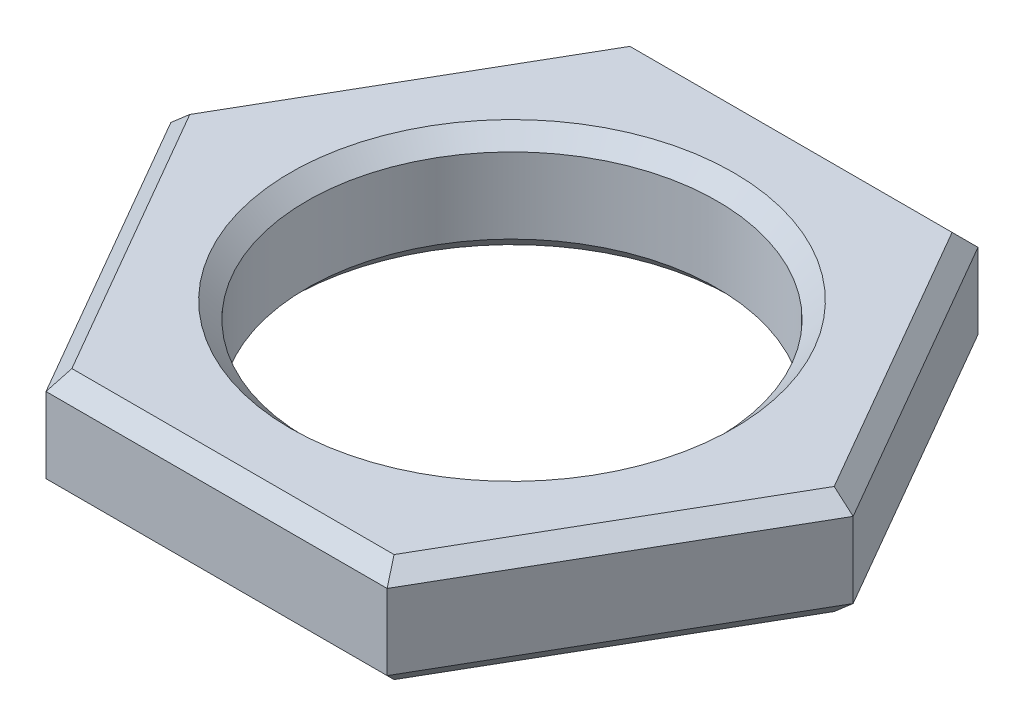
ISO-10303-21;
HEADER;
FILE_DESCRIPTION(('STEP AP214'),'2;1');
FILE_NAME('part.step','',(''),(''),'','','');
FILE_SCHEMA(('AUTOMOTIVE_DESIGN { 1 0 10303 214 1 1 1 1 }'));
ENDSEC;
DATA;
#1=APPLICATION_CONTEXT('core data for automotive mechanical design processes');
#2=APPLICATION_PROTOCOL_DEFINITION('international standard','automotive_design',2000,#1);
#3=PRODUCT_CONTEXT('',#1,'mechanical');
#4=PRODUCT('Part','Part','',(#3));
#5=PRODUCT_RELATED_PRODUCT_CATEGORY('part','',(#4));
#6=PRODUCT_DEFINITION_FORMATION('','',#4);
#7=PRODUCT_DEFINITION_CONTEXT('part definition',#1,'design');
#8=PRODUCT_DEFINITION('design','',#6,#7);
#9=PRODUCT_DEFINITION_SHAPE('','',#8);
#10=(LENGTH_UNIT() NAMED_UNIT(*) SI_UNIT(.MILLI.,.METRE.));
#11=(NAMED_UNIT(*) PLANE_ANGLE_UNIT() SI_UNIT($,.RADIAN.));
#12=(NAMED_UNIT(*) SI_UNIT($,.STERADIAN.) SOLID_ANGLE_UNIT());
#13=UNCERTAINTY_MEASURE_WITH_UNIT(LENGTH_MEASURE(1.E-05),#10,'distance_accuracy_value','');
#14=(GEOMETRIC_REPRESENTATION_CONTEXT(3) GLOBAL_UNCERTAINTY_ASSIGNED_CONTEXT((#13)) GLOBAL_UNIT_ASSIGNED_CONTEXT((#10,
#11,#12)) REPRESENTATION_CONTEXT('',''));
#15=CARTESIAN_POINT('',(0.,0.,0.));
#16=DIRECTION('',(0.,0.,1.));
#17=DIRECTION('',(1.,0.,0.));
#18=AXIS2_PLACEMENT_3D('',#15,#16,#17);
#19=CARTESIAN_POINT('',(0.,1.65,0.));
#20=DIRECTION('',(0.,1.,0.));
#21=DIRECTION('',(0.,0.,1.));
#22=AXIS2_PLACEMENT_3D('',#19,#20,#21);
#23=PLANE('',#22);
#24=CARTESIAN_POINT('',(0.,1.65,0.));
#25=DIRECTION('',(0.,1.,0.));
#26=DIRECTION('',(0.,0.,1.));
#27=AXIS2_PLACEMENT_3D('',#24,#25,#26);
#28=CIRCLE('',#27,3.375);
#29=CARTESIAN_POINT('',(0.,1.65,3.375));
#30=VERTEX_POINT('',#29);
#31=EDGE_CURVE('E11',#30,#30,#28,.F.);
#32=ORIENTED_EDGE('',*,*,#31,.T.);
#33=EDGE_LOOP('',(#32));
#34=FACE_BOUND('',#33,.T.);
#35=DIRECTION('',(0.500000000000007,0.,0.866025403784435));
#36=VECTOR('',#35,1.);
#37=CARTESIAN_POINT('',(-2.38156986040717,1.65,4.37500000000002));
#38=LINE('',#37,#36);
#39=CARTESIAN_POINT('',(-4.90747728811182,1.65,0.));
#40=VERTEX_POINT('',#39);
#41=CARTESIAN_POINT('',(-2.45373864405587,1.65,4.25000000000002));
#42=VERTEX_POINT('',#41);
#43=EDGE_CURVE('E57',#40,#42,#38,.T.);
#44=ORIENTED_EDGE('',*,*,#43,.T.);
#45=DIRECTION('',(1.,0.,0.));
#46=VECTOR('',#45,1.);
#47=CARTESIAN_POINT('',(2.59807621135337,1.65,4.24999999999997));
#48=LINE('',#47,#46);
#49=CARTESIAN_POINT('',(2.45373864405596,1.65,4.24999999999997));
#50=VERTEX_POINT('',#49);
#51=EDGE_CURVE('E49',#42,#50,#48,.T.);
#52=ORIENTED_EDGE('',*,*,#51,.T.);
#53=DIRECTION('',(0.499999999999995,0.,-0.866025403784442));
#54=VECTOR('',#53,1.);
#55=CARTESIAN_POINT('',(4.97964607176052,1.65,-0.124999999999999));
#56=LINE('',#55,#54);
#57=CARTESIAN_POINT('',(4.90747728811182,1.65,0.));
#58=VERTEX_POINT('',#57);
#59=EDGE_CURVE('E215',#50,#58,#56,.T.);
#60=ORIENTED_EDGE('',*,*,#59,.T.);
#61=DIRECTION('',(-0.500000000000001,0.,-0.866025403784438));
#62=VECTOR('',#61,1.);
#63=CARTESIAN_POINT('',(2.3815698604072,1.65,-4.37500000000001));
#64=LINE('',#63,#62);
#65=CARTESIAN_POINT('',(2.4537386440559,1.65,-4.25000000000001));
#66=VERTEX_POINT('',#65);
#67=EDGE_CURVE('E218',#58,#66,#64,.T.);
#68=ORIENTED_EDGE('',*,*,#67,.T.);
#69=DIRECTION('',(-1.,0.,0.));
#70=VECTOR('',#69,1.);
#71=CARTESIAN_POINT('',(-2.59807621135334,1.65,-4.24999999999999));
#72=LINE('',#71,#70);
#73=CARTESIAN_POINT('',(-2.45373864405593,1.65,-4.24999999999999));
#74=VERTEX_POINT('',#73);
#75=EDGE_CURVE('E221',#66,#74,#72,.T.);
#76=ORIENTED_EDGE('',*,*,#75,.T.);
#77=DIRECTION('',(-0.499999999999995,0.,0.866025403784442));
#78=VECTOR('',#77,1.);
#79=CARTESIAN_POINT('',(-4.97964607176053,1.65,0.125000000000035));
#80=LINE('',#79,#78);
#81=EDGE_CURVE('E62',#74,#40,#80,.T.);
#82=ORIENTED_EDGE('',*,*,#81,.T.);
#83=EDGE_LOOP('',(#44,#52,#60,#68,#76,#82));
#84=FACE_BOUND('',#83,.T.);
#85=ADVANCED_FACE('F39',(#34,#84),#23,.T.);
#86=CARTESIAN_POINT('',(0.,0.,0.));
#87=DIRECTION('',(0.,1.,0.));
#88=DIRECTION('',(0.,0.,1.));
#89=AXIS2_PLACEMENT_3D('',#86,#87,#88);
#90=PLANE('',#89);
#91=CARTESIAN_POINT('',(0.,0.,0.));
#92=DIRECTION('',(0.,1.,0.));
#93=DIRECTION('',(0.,0.,1.));
#94=AXIS2_PLACEMENT_3D('',#91,#92,#93);
#95=CIRCLE('',#94,3.375);
#96=CARTESIAN_POINT('',(0.,0.,3.375));
#97=VERTEX_POINT('',#96);
#98=EDGE_CURVE('E161',#97,#97,#95,.T.);
#99=ORIENTED_EDGE('',*,*,#98,.T.);
#100=EDGE_LOOP('',(#99));
#101=FACE_BOUND('',#100,.T.);
#102=DIRECTION('',(1.,0.,0.));
#103=VECTOR('',#102,1.);
#104=CARTESIAN_POINT('',(0.,0.,-4.25));
#105=LINE('',#104,#103);
#106=CARTESIAN_POINT('',(-2.45373864405593,0.,-4.24999999999999));
#107=VERTEX_POINT('',#106);
#108=CARTESIAN_POINT('',(2.4537386440559,0.,-4.25000000000001));
#109=VERTEX_POINT('',#108);
#110=EDGE_CURVE('E159',#107,#109,#105,.T.);
#111=ORIENTED_EDGE('',*,*,#110,.T.);
#112=DIRECTION('',(0.500000000000001,0.,0.866025403784438));
#113=VECTOR('',#112,1.);
#114=CARTESIAN_POINT('',(3.68060796608386,0.,-2.125));
#115=LINE('',#114,#113);
#116=CARTESIAN_POINT('',(4.90747728811182,0.,0.));
#117=VERTEX_POINT('',#116);
#118=EDGE_CURVE('E136',#109,#117,#115,.T.);
#119=ORIENTED_EDGE('',*,*,#118,.T.);
#120=DIRECTION('',(-0.499999999999995,0.,0.866025403784442));
#121=VECTOR('',#120,1.);
#122=CARTESIAN_POINT('',(3.68060796608389,0.,2.12499999999999));
#123=LINE('',#122,#121);
#124=CARTESIAN_POINT('',(2.45373864405596,0.,4.24999999999997));
#125=VERTEX_POINT('',#124);
#126=EDGE_CURVE('E147',#117,#125,#123,.T.);
#127=ORIENTED_EDGE('',*,*,#126,.T.);
#128=DIRECTION('',(-1.,0.,0.));
#129=VECTOR('',#128,1.);
#130=CARTESIAN_POINT('',(0.,0.,4.25));
#131=LINE('',#130,#129);
#132=CARTESIAN_POINT('',(-2.45373864405587,0.,4.25000000000002));
#133=VERTEX_POINT('',#132);
#134=EDGE_CURVE('E154',#125,#133,#131,.T.);
#135=ORIENTED_EDGE('',*,*,#134,.T.);
#136=DIRECTION('',(-0.500000000000007,0.,-0.866025403784435));
#137=VECTOR('',#136,1.);
#138=CARTESIAN_POINT('',(-3.68060796608385,0.,2.12500000000003));
#139=LINE('',#138,#137);
#140=CARTESIAN_POINT('',(-4.90747728811182,0.,0.));
#141=VERTEX_POINT('',#140);
#142=EDGE_CURVE('E298',#133,#141,#139,.T.);
#143=ORIENTED_EDGE('',*,*,#142,.T.);
#144=DIRECTION('',(0.499999999999995,0.,-0.866025403784442));
#145=VECTOR('',#144,1.);
#146=CARTESIAN_POINT('',(-3.68060796608388,0.,-2.12499999999998));
#147=LINE('',#146,#145);
#148=EDGE_CURVE('E168',#141,#107,#147,.T.);
#149=ORIENTED_EDGE('',*,*,#148,.T.);
#150=EDGE_LOOP('',(#111,#119,#127,#135,#143,#149));
#151=FACE_BOUND('',#150,.T.);
#152=ADVANCED_FACE('F157',(#101,#151),#90,.F.);
#153=CARTESIAN_POINT('',(2.59807621135337,1.65,4.49999999999997));
#154=DIRECTION('',(-0.866025403784442,0.,-0.499999999999995));
#155=DIRECTION('',(-0.499999999999995,0.,0.866025403784442));
#156=AXIS2_PLACEMENT_3D('',#153,#154,#155);
#157=PLANE('',#156);
#158=DIRECTION('',(0.,-1.,0.));
#159=VECTOR('',#158,1.);
#160=CARTESIAN_POINT('',(2.59807621135337,1.65,4.49999999999997));
#161=LINE('',#160,#159);
#162=CARTESIAN_POINT('',(2.59807621135337,1.4,4.49999999999997));
#163=VERTEX_POINT('',#162);
#164=CARTESIAN_POINT('',(2.59807621135337,0.250000000000001,4.49999999999997));
#165=VERTEX_POINT('',#164);
#166=EDGE_CURVE('E245',#163,#165,#161,.T.);
#167=ORIENTED_EDGE('',*,*,#166,.T.);
#168=DIRECTION('',(0.499999999999995,0.,-0.866025403784442));
#169=VECTOR('',#168,1.);
#170=CARTESIAN_POINT('',(2.59807621135337,0.250000000000001,4.49999999999997));
#171=LINE('',#170,#169);
#172=CARTESIAN_POINT('',(5.19615242270664,0.250000000000001,0.));
#173=VERTEX_POINT('',#172);
#174=EDGE_CURVE('E212',#165,#173,#171,.T.);
#175=ORIENTED_EDGE('',*,*,#174,.T.);
#176=DIRECTION('',(0.,-1.,0.));
#177=VECTOR('',#176,1.);
#178=CARTESIAN_POINT('',(5.19615242270664,1.65,0.));
#179=LINE('',#178,#177);
#180=CARTESIAN_POINT('',(5.19615242270664,1.4,0.));
#181=VERTEX_POINT('',#180);
#182=EDGE_CURVE('E155',#181,#173,#179,.T.);
#183=ORIENTED_EDGE('',*,*,#182,.F.);
#184=DIRECTION('',(-0.499999999999995,0.,0.866025403784442));
#185=VECTOR('',#184,1.);
#186=CARTESIAN_POINT('',(2.59807621135337,1.4,4.49999999999997));
#187=LINE('',#186,#185);
#188=EDGE_CURVE('E209',#181,#163,#187,.T.);
#189=ORIENTED_EDGE('',*,*,#188,.T.);
#190=EDGE_LOOP('',(#167,#175,#183,#189));
#191=FACE_BOUND('',#190,.T.);
#192=ADVANCED_FACE('F327',(#191),#157,.F.);
#193=CARTESIAN_POINT('',(5.19615242270664,1.65,0.));
#194=DIRECTION('',(-0.866025403784438,0.,0.500000000000001));
#195=DIRECTION('',(0.500000000000001,0.,0.866025403784438));
#196=AXIS2_PLACEMENT_3D('',#193,#194,#195);
#197=PLANE('',#196);
#198=ORIENTED_EDGE('',*,*,#182,.T.);
#199=DIRECTION('',(-0.500000000000001,0.,-0.866025403784438));
#200=VECTOR('',#199,1.);
#201=CARTESIAN_POINT('',(5.19615242270664,0.250000000000001,0.));
#202=LINE('',#201,#200);
#203=CARTESIAN_POINT('',(2.59807621135331,0.25,-4.50000000000001));
#204=VERTEX_POINT('',#203);
#205=EDGE_CURVE('E139',#173,#204,#202,.T.);
#206=ORIENTED_EDGE('',*,*,#205,.T.);
#207=DIRECTION('',(0.,-1.,0.));
#208=VECTOR('',#207,1.);
#209=CARTESIAN_POINT('',(2.59807621135331,1.65,-4.50000000000001));
#210=LINE('',#209,#208);
#211=CARTESIAN_POINT('',(2.59807621135331,1.4,-4.50000000000001));
#212=VERTEX_POINT('',#211);
#213=EDGE_CURVE('E280',#212,#204,#210,.T.);
#214=ORIENTED_EDGE('',*,*,#213,.F.);
#215=DIRECTION('',(0.500000000000001,0.,0.866025403784438));
#216=VECTOR('',#215,1.);
#217=CARTESIAN_POINT('',(5.19615242270664,1.4,0.));
#218=LINE('',#217,#216);
#219=EDGE_CURVE('E179',#212,#181,#218,.T.);
#220=ORIENTED_EDGE('',*,*,#219,.T.);
#221=EDGE_LOOP('',(#198,#206,#214,#220));
#222=FACE_BOUND('',#221,.T.);
#223=ADVANCED_FACE('F285',(#222),#197,.F.);
#224=CARTESIAN_POINT('',(2.59807621135331,1.65,-4.50000000000001));
#225=DIRECTION('',(0.,0.,1.));
#226=DIRECTION('',(1.,0.,0.));
#227=AXIS2_PLACEMENT_3D('',#224,#225,#226);
#228=PLANE('',#227);
#229=ORIENTED_EDGE('',*,*,#213,.T.);
#230=DIRECTION('',(-1.,0.,0.));
#231=VECTOR('',#230,1.);
#232=CARTESIAN_POINT('',(2.59807621135331,0.25,-4.50000000000001));
#233=LINE('',#232,#231);
#234=CARTESIAN_POINT('',(-2.59807621135334,0.25,-4.49999999999999));
#235=VERTEX_POINT('',#234);
#236=EDGE_CURVE('E187',#204,#235,#233,.T.);
#237=ORIENTED_EDGE('',*,*,#236,.T.);
#238=DIRECTION('',(0.,-1.,0.));
#239=VECTOR('',#238,1.);
#240=CARTESIAN_POINT('',(-2.59807621135334,1.65,-4.49999999999999));
#241=LINE('',#240,#239);
#242=CARTESIAN_POINT('',(-2.59807621135334,1.4,-4.49999999999999));
#243=VERTEX_POINT('',#242);
#244=EDGE_CURVE('E282',#243,#235,#241,.T.);
#245=ORIENTED_EDGE('',*,*,#244,.F.);
#246=DIRECTION('',(1.,0.,0.));
#247=VECTOR('',#246,1.);
#248=CARTESIAN_POINT('',(2.59807621135331,1.4,-4.50000000000001));
#249=LINE('',#248,#247);
#250=EDGE_CURVE('E184',#243,#212,#249,.T.);
#251=ORIENTED_EDGE('',*,*,#250,.T.);
#252=EDGE_LOOP('',(#229,#237,#245,#251));
#253=FACE_BOUND('',#252,.T.);
#254=ADVANCED_FACE('F279',(#253),#228,.F.);
#255=CARTESIAN_POINT('',(-2.59807621135334,1.65,-4.49999999999999));
#256=DIRECTION('',(0.866025403784442,0.,0.499999999999995));
#257=DIRECTION('',(0.499999999999995,0.,-0.866025403784442));
#258=AXIS2_PLACEMENT_3D('',#255,#256,#257);
#259=PLANE('',#258);
#260=ORIENTED_EDGE('',*,*,#244,.T.);
#261=DIRECTION('',(-0.499999999999995,0.,0.866025403784442));
#262=VECTOR('',#261,1.);
#263=CARTESIAN_POINT('',(-2.59807621135334,0.25,-4.49999999999999));
#264=LINE('',#263,#262);
#265=CARTESIAN_POINT('',(-5.19615242270664,0.25,0.));
#266=VERTEX_POINT('',#265);
#267=EDGE_CURVE('E193',#235,#266,#264,.T.);
#268=ORIENTED_EDGE('',*,*,#267,.T.);
#269=DIRECTION('',(0.,-1.,0.));
#270=VECTOR('',#269,1.);
#271=CARTESIAN_POINT('',(-5.19615242270664,1.65,0.));
#272=LINE('',#271,#270);
#273=CARTESIAN_POINT('',(-5.19615242270664,1.4,0.));
#274=VERTEX_POINT('',#273);
#275=EDGE_CURVE('E292',#274,#266,#272,.T.);
#276=ORIENTED_EDGE('',*,*,#275,.F.);
#277=DIRECTION('',(0.499999999999995,0.,-0.866025403784442));
#278=VECTOR('',#277,1.);
#279=CARTESIAN_POINT('',(-2.59807621135334,1.4,-4.49999999999999));
#280=LINE('',#279,#278);
#281=EDGE_CURVE('E190',#274,#243,#280,.T.);
#282=ORIENTED_EDGE('',*,*,#281,.T.);
#283=EDGE_LOOP('',(#260,#268,#276,#282));
#284=FACE_BOUND('',#283,.T.);
#285=ADVANCED_FACE('F312',(#284),#259,.F.);
#286=CARTESIAN_POINT('',(-5.19615242270664,1.65,0.));
#287=DIRECTION('',(0.866025403784435,0.,-0.500000000000007));
#288=DIRECTION('',(-0.500000000000007,0.,-0.866025403784435));
#289=AXIS2_PLACEMENT_3D('',#286,#287,#288);
#290=PLANE('',#289);
#291=ORIENTED_EDGE('',*,*,#275,.T.);
#292=DIRECTION('',(0.500000000000007,0.,0.866025403784435));
#293=VECTOR('',#292,1.);
#294=CARTESIAN_POINT('',(-5.19615242270664,0.25,0.));
#295=LINE('',#294,#293);
#296=CARTESIAN_POINT('',(-2.59807621135328,0.25,4.50000000000003));
#297=VERTEX_POINT('',#296);
#298=EDGE_CURVE('E199',#266,#297,#295,.T.);
#299=ORIENTED_EDGE('',*,*,#298,.T.);
#300=DIRECTION('',(0.,-1.,0.));
#301=VECTOR('',#300,1.);
#302=CARTESIAN_POINT('',(-2.59807621135328,1.65,4.50000000000003));
#303=LINE('',#302,#301);
#304=CARTESIAN_POINT('',(-2.59807621135328,1.4,4.50000000000003));
#305=VERTEX_POINT('',#304);
#306=EDGE_CURVE('E318',#305,#297,#303,.T.);
#307=ORIENTED_EDGE('',*,*,#306,.F.);
#308=DIRECTION('',(-0.500000000000007,0.,-0.866025403784435));
#309=VECTOR('',#308,1.);
#310=CARTESIAN_POINT('',(-5.19615242270664,1.4,0.));
#311=LINE('',#310,#309);
#312=EDGE_CURVE('E196',#305,#274,#311,.T.);
#313=ORIENTED_EDGE('',*,*,#312,.T.);
#314=EDGE_LOOP('',(#291,#299,#307,#313));
#315=FACE_BOUND('',#314,.T.);
#316=ADVANCED_FACE('F338',(#315),#290,.F.);
#317=CARTESIAN_POINT('',(-2.59807621135328,1.65,4.50000000000003));
#318=DIRECTION('',(0.,0.,-1.));
#319=DIRECTION('',(-1.,0.,0.));
#320=AXIS2_PLACEMENT_3D('',#317,#318,#319);
#321=PLANE('',#320);
#322=ORIENTED_EDGE('',*,*,#306,.T.);
#323=DIRECTION('',(1.,0.,0.));
#324=VECTOR('',#323,1.);
#325=CARTESIAN_POINT('',(-2.59807621135328,0.25,4.50000000000003));
#326=LINE('',#325,#324);
#327=EDGE_CURVE('E206',#297,#165,#326,.T.);
#328=ORIENTED_EDGE('',*,*,#327,.T.);
#329=ORIENTED_EDGE('',*,*,#166,.F.);
#330=DIRECTION('',(-1.,0.,0.));
#331=VECTOR('',#330,1.);
#332=CARTESIAN_POINT('',(-2.59807621135328,1.4,4.50000000000003));
#333=LINE('',#332,#331);
#334=EDGE_CURVE('E202',#163,#305,#333,.T.);
#335=ORIENTED_EDGE('',*,*,#334,.T.);
#336=EDGE_LOOP('',(#322,#328,#329,#335));
#337=FACE_BOUND('',#336,.T.);
#338=ADVANCED_FACE('F339',(#337),#321,.F.);
#339=CARTESIAN_POINT('',(0.,1.65,0.));
#340=DIRECTION('',(0.,-1.,0.));
#341=DIRECTION('',(0.,0.,-1.));
#342=AXIS2_PLACEMENT_3D('',#339,#340,#341);
#343=CYLINDRICAL_SURFACE('',#342,3.125);
#344=CARTESIAN_POINT('',(0.,0.250000000000001,0.));
#345=DIRECTION('',(0.,1.,0.));
#346=DIRECTION('',(0.,0.,1.));
#347=AXIS2_PLACEMENT_3D('',#344,#345,#346);
#348=CIRCLE('',#347,3.125);
#349=CARTESIAN_POINT('',(0.,0.250000000000001,3.125));
#350=VERTEX_POINT('',#349);
#351=EDGE_CURVE('E175',#350,#350,#348,.F.);
#352=ORIENTED_EDGE('',*,*,#351,.T.);
#353=EDGE_LOOP('',(#352));
#354=FACE_BOUND('',#353,.T.);
#355=CARTESIAN_POINT('',(0.,1.4,0.));
#356=DIRECTION('',(0.,1.,0.));
#357=DIRECTION('',(0.,0.,1.));
#358=AXIS2_PLACEMENT_3D('',#355,#356,#357);
#359=CIRCLE('',#358,3.125);
#360=CARTESIAN_POINT('',(0.,1.4,3.125));
#361=VERTEX_POINT('',#360);
#362=EDGE_CURVE('E166',#361,#361,#359,.T.);
#363=ORIENTED_EDGE('',*,*,#362,.T.);
#364=EDGE_LOOP('',(#363));
#365=FACE_BOUND('',#364,.T.);
#366=ADVANCED_FACE('F358',(#354,#365),#343,.F.);
#367=CARTESIAN_POINT('',(0.,0.,0.));
#368=DIRECTION('',(0.,-1.,0.));
#369=DIRECTION('',(0.,0.,-1.));
#370=AXIS2_PLACEMENT_3D('',#367,#368,#369);
#371=CONICAL_SURFACE('',#370,3.375,0.785398163397447);
#372=ORIENTED_EDGE('',*,*,#351,.F.);
#373=EDGE_LOOP('',(#372));
#374=FACE_BOUND('',#373,.T.);
#375=ORIENTED_EDGE('',*,*,#98,.F.);
#376=EDGE_LOOP('',(#375));
#377=FACE_BOUND('',#376,.T.);
#378=ADVANCED_FACE('F372',(#374,#377),#371,.F.);
#379=CARTESIAN_POINT('',(-5.19615242270664,0.25,0.));
#380=DIRECTION('',(0.612372435695791,0.707106781186548,-0.353553390593278));
#381=DIRECTION('',(0.500000000000007,0.,0.866025403784435));
#382=AXIS2_PLACEMENT_3D('',#379,#380,#381);
#383=PLANE('',#382);
#384=DIRECTION('',(0.755928946018454,-0.654653670707977,0.));
#385=VECTOR('',#384,1.);
#386=CARTESIAN_POINT('',(-5.19615242270664,0.25,0.));
#387=LINE('',#386,#385);
#388=EDGE_CURVE('E237',#141,#266,#387,.F.);
#389=ORIENTED_EDGE('',*,*,#388,.F.);
#390=ORIENTED_EDGE('',*,*,#142,.F.);
#391=DIRECTION('',(0.377964473009222,-0.654653670707977,-0.65465367070798));
#392=VECTOR('',#391,1.);
#393=CARTESIAN_POINT('',(-2.59807621135328,0.25,4.50000000000003));
#394=LINE('',#393,#392);
#395=EDGE_CURVE('E241',#297,#133,#394,.T.);
#396=ORIENTED_EDGE('',*,*,#395,.F.);
#397=ORIENTED_EDGE('',*,*,#298,.F.);
#398=EDGE_LOOP('',(#389,#390,#396,#397));
#399=FACE_BOUND('',#398,.T.);
#400=ADVANCED_FACE('F336',(#399),#383,.F.);
#401=CARTESIAN_POINT('',(-2.59807621135328,0.25,4.50000000000003));
#402=DIRECTION('',(0.,0.707106781186547,-0.707106781186547));
#403=DIRECTION('',(1.,0.,0.));
#404=AXIS2_PLACEMENT_3D('',#401,#402,#403);
#405=PLANE('',#404);
#406=ORIENTED_EDGE('',*,*,#395,.T.);
#407=ORIENTED_EDGE('',*,*,#134,.F.);
#408=DIRECTION('',(-0.377964473009234,-0.654653670707977,-0.654653670707973));
#409=VECTOR('',#408,1.);
#410=CARTESIAN_POINT('',(2.59807621135337,0.25,4.49999999999997));
#411=LINE('',#410,#409);
#412=EDGE_CURVE('E150',#165,#125,#411,.T.);
#413=ORIENTED_EDGE('',*,*,#412,.F.);
#414=ORIENTED_EDGE('',*,*,#327,.F.);
#415=EDGE_LOOP('',(#406,#407,#413,#414));
#416=FACE_BOUND('',#415,.T.);
#417=ADVANCED_FACE('F333',(#416),#405,.F.);
#418=CARTESIAN_POINT('',(-2.59807621135334,0.25,-4.49999999999999));
#419=DIRECTION('',(0.612372435695798,0.707106781186546,0.353553390593271));
#420=DIRECTION('',(-0.499999999999995,0.,0.866025403784442));
#421=AXIS2_PLACEMENT_3D('',#418,#419,#420);
#422=PLANE('',#421);
#423=ORIENTED_EDGE('',*,*,#388,.T.);
#424=ORIENTED_EDGE('',*,*,#267,.F.);
#425=DIRECTION('',(0.377964473009228,-0.654653670707978,0.654653670707976));
#426=VECTOR('',#425,1.);
#427=CARTESIAN_POINT('',(-2.59807621135334,0.25,-4.49999999999999));
#428=LINE('',#427,#426);
#429=EDGE_CURVE('E143',#107,#235,#428,.F.);
#430=ORIENTED_EDGE('',*,*,#429,.F.);
#431=ORIENTED_EDGE('',*,*,#148,.F.);
#432=EDGE_LOOP('',(#423,#424,#430,#431));
#433=FACE_BOUND('',#432,.T.);
#434=ADVANCED_FACE('F307',(#433),#422,.F.);
#435=CARTESIAN_POINT('',(2.59807621135337,0.25,4.49999999999997));
#436=DIRECTION('',(-0.612372435695796,0.707106781186548,-0.35355339059327));
#437=DIRECTION('',(0.499999999999995,0.,-0.866025403784442));
#438=AXIS2_PLACEMENT_3D('',#435,#436,#437);
#439=PLANE('',#438);
#440=ORIENTED_EDGE('',*,*,#412,.T.);
#441=ORIENTED_EDGE('',*,*,#126,.F.);
#442=DIRECTION('',(0.755928946018454,0.654653670707978,0.));
#443=VECTOR('',#442,1.);
#444=CARTESIAN_POINT('',(3.71153744479049,-1.03571428571426,0.));
#445=LINE('',#444,#443);
#446=EDGE_CURVE('E132',#173,#117,#445,.F.);
#447=ORIENTED_EDGE('',*,*,#446,.F.);
#448=ORIENTED_EDGE('',*,*,#174,.F.);
#449=EDGE_LOOP('',(#440,#441,#447,#448));
#450=FACE_BOUND('',#449,.T.);
#451=ADVANCED_FACE('F148',(#450),#439,.F.);
#452=CARTESIAN_POINT('',(2.59807621135331,0.25,-4.50000000000001));
#453=DIRECTION('',(0.,0.707106781186547,0.707106781186548));
#454=DIRECTION('',(-1.,0.,0.));
#455=AXIS2_PLACEMENT_3D('',#452,#453,#454);
#456=PLANE('',#455);
#457=ORIENTED_EDGE('',*,*,#429,.T.);
#458=ORIENTED_EDGE('',*,*,#236,.F.);
#459=DIRECTION('',(-0.377964473009226,-0.654653670707978,0.654653670707978));
#460=VECTOR('',#459,1.);
#461=CARTESIAN_POINT('',(2.59807621135331,0.25,-4.50000000000001));
#462=LINE('',#461,#460);
#463=EDGE_CURVE('E144',#109,#204,#462,.F.);
#464=ORIENTED_EDGE('',*,*,#463,.F.);
#465=ORIENTED_EDGE('',*,*,#110,.F.);
#466=EDGE_LOOP('',(#457,#458,#464,#465));
#467=FACE_BOUND('',#466,.T.);
#468=ADVANCED_FACE('F310',(#467),#456,.F.);
#469=CARTESIAN_POINT('',(5.19615242270664,0.25,0.));
#470=DIRECTION('',(-0.612372435695795,0.707106781186547,0.353553390593275));
#471=DIRECTION('',(-0.500000000000001,0.,-0.866025403784438));
#472=AXIS2_PLACEMENT_3D('',#469,#470,#471);
#473=PLANE('',#472);
#474=ORIENTED_EDGE('',*,*,#446,.T.);
#475=ORIENTED_EDGE('',*,*,#118,.F.);
#476=ORIENTED_EDGE('',*,*,#463,.T.);
#477=ORIENTED_EDGE('',*,*,#205,.F.);
#478=EDGE_LOOP('',(#474,#475,#476,#477));
#479=FACE_BOUND('',#478,.T.);
#480=ADVANCED_FACE('F134',(#479),#473,.F.);
#481=CARTESIAN_POINT('',(0.,1.4,0.));
#482=DIRECTION('',(0.,1.,0.));
#483=DIRECTION('',(0.,0.,1.));
#484=AXIS2_PLACEMENT_3D('',#481,#482,#483);
#485=CONICAL_SURFACE('',#484,3.125,0.785398163397451);
#486=ORIENTED_EDGE('',*,*,#31,.F.);
#487=EDGE_LOOP('',(#486));
#488=FACE_BOUND('',#487,.T.);
#489=ORIENTED_EDGE('',*,*,#362,.F.);
#490=EDGE_LOOP('',(#489));
#491=FACE_BOUND('',#490,.T.);
#492=ADVANCED_FACE('F378',(#488,#491),#485,.F.);
#493=CARTESIAN_POINT('',(0.,1.65,-4.25));
#494=DIRECTION('',(0.,0.707106781186547,-0.707106781186548));
#495=DIRECTION('',(1.,0.,0.));
#496=AXIS2_PLACEMENT_3D('',#493,#494,#495);
#497=PLANE('',#496);
#498=DIRECTION('',(-0.377964473009225,0.654653670707978,0.654653670707978));
#499=VECTOR('',#498,1.);
#500=CARTESIAN_POINT('',(2.10320455204791,2.25714285714286,-3.64285714285715));
#501=LINE('',#500,#499);
#502=EDGE_CURVE('E259',#212,#66,#501,.T.);
#503=ORIENTED_EDGE('',*,*,#502,.F.);
#504=ORIENTED_EDGE('',*,*,#250,.F.);
#505=DIRECTION('',(0.377964473009228,0.654653670707978,0.654653670707976));
#506=VECTOR('',#505,1.);
#507=CARTESIAN_POINT('',(-2.10320455204794,2.25714285714286,-3.64285714285714));
#508=LINE('',#507,#506);
#509=EDGE_CURVE('E43',#74,#243,#508,.F.);
#510=ORIENTED_EDGE('',*,*,#509,.F.);
#511=ORIENTED_EDGE('',*,*,#75,.F.);
#512=EDGE_LOOP('',(#503,#504,#510,#511));
#513=FACE_BOUND('',#512,.T.);
#514=ADVANCED_FACE('F41',(#513),#497,.T.);
#515=CARTESIAN_POINT('',(-3.68060796608388,1.65,-2.12499999999998));
#516=DIRECTION('',(-0.612372435695798,0.707106781186546,-0.353553390593271));
#517=DIRECTION('',(0.499999999999995,0.,-0.866025403784442));
#518=AXIS2_PLACEMENT_3D('',#515,#516,#517);
#519=PLANE('',#518);
#520=ORIENTED_EDGE('',*,*,#509,.T.);
#521=ORIENTED_EDGE('',*,*,#281,.F.);
#522=DIRECTION('',(0.755928946018454,0.654653670707977,0.));
#523=VECTOR('',#522,1.);
#524=CARTESIAN_POINT('',(-4.20640910409584,2.25714285714287,0.));
#525=LINE('',#524,#523);
#526=EDGE_CURVE('E256',#40,#274,#525,.F.);
#527=ORIENTED_EDGE('',*,*,#526,.F.);
#528=ORIENTED_EDGE('',*,*,#81,.F.);
#529=EDGE_LOOP('',(#520,#521,#527,#528));
#530=FACE_BOUND('',#529,.T.);
#531=ADVANCED_FACE('F271',(#530),#519,.T.);
#532=CARTESIAN_POINT('',(3.68060796608386,1.65,-2.125));
#533=DIRECTION('',(0.612372435695795,0.707106781186547,-0.353553390593275));
#534=DIRECTION('',(0.500000000000001,0.,0.866025403784438));
#535=AXIS2_PLACEMENT_3D('',#532,#533,#534);
#536=PLANE('',#535);
#537=ORIENTED_EDGE('',*,*,#502,.T.);
#538=ORIENTED_EDGE('',*,*,#67,.F.);
#539=DIRECTION('',(-0.755928946018454,0.654653670707978,0.));
#540=VECTOR('',#539,1.);
#541=CARTESIAN_POINT('',(4.20640910409586,2.25714285714285,0.));
#542=LINE('',#541,#540);
#543=EDGE_CURVE('E252',#181,#58,#542,.T.);
#544=ORIENTED_EDGE('',*,*,#543,.F.);
#545=ORIENTED_EDGE('',*,*,#219,.F.);
#546=EDGE_LOOP('',(#537,#538,#544,#545));
#547=FACE_BOUND('',#546,.T.);
#548=ADVANCED_FACE('F399',(#547),#536,.T.);
#549=CARTESIAN_POINT('',(-3.68060796608385,1.65,2.12500000000003));
#550=DIRECTION('',(-0.612372435695791,0.707106781186548,0.353553390593278));
#551=DIRECTION('',(-0.500000000000007,0.,-0.866025403784435));
#552=AXIS2_PLACEMENT_3D('',#549,#550,#551);
#553=PLANE('',#552);
#554=ORIENTED_EDGE('',*,*,#526,.T.);
#555=ORIENTED_EDGE('',*,*,#312,.F.);
#556=DIRECTION('',(0.377964473009222,0.654653670707977,-0.65465367070798));
#557=VECTOR('',#556,1.);
#558=CARTESIAN_POINT('',(-2.10320455204789,2.25714285714286,3.64285714285716));
#559=LINE('',#558,#557);
#560=EDGE_CURVE('E249',#42,#305,#559,.F.);
#561=ORIENTED_EDGE('',*,*,#560,.F.);
#562=ORIENTED_EDGE('',*,*,#43,.F.);
#563=EDGE_LOOP('',(#554,#555,#561,#562));
#564=FACE_BOUND('',#563,.T.);
#565=ADVANCED_FACE('F396',(#564),#553,.T.);
#566=CARTESIAN_POINT('',(3.68060796608389,1.65,2.12499999999999));
#567=DIRECTION('',(0.612372435695797,0.707106781186547,0.35355339059327));
#568=DIRECTION('',(-0.499999999999995,0.,0.866025403784442));
#569=AXIS2_PLACEMENT_3D('',#566,#567,#568);
#570=PLANE('',#569);
#571=ORIENTED_EDGE('',*,*,#543,.T.);
#572=ORIENTED_EDGE('',*,*,#59,.F.);
#573=DIRECTION('',(0.377964473009232,-0.654653670707978,0.654653670707974));
#574=VECTOR('',#573,1.);
#575=CARTESIAN_POINT('',(2.10320455204798,2.25714285714285,3.64285714285713));
#576=LINE('',#575,#574);
#577=EDGE_CURVE('E246',#163,#50,#576,.F.);
#578=ORIENTED_EDGE('',*,*,#577,.F.);
#579=ORIENTED_EDGE('',*,*,#188,.F.);
#580=EDGE_LOOP('',(#571,#572,#578,#579));
#581=FACE_BOUND('',#580,.T.);
#582=ADVANCED_FACE('F347',(#581),#570,.T.);
#583=CARTESIAN_POINT('',(0.,1.65,4.25));
#584=DIRECTION('',(0.,0.707106781186547,0.707106781186547));
#585=DIRECTION('',(-1.,0.,0.));
#586=AXIS2_PLACEMENT_3D('',#583,#584,#585);
#587=PLANE('',#586);
#588=ORIENTED_EDGE('',*,*,#560,.T.);
#589=ORIENTED_EDGE('',*,*,#334,.F.);
#590=ORIENTED_EDGE('',*,*,#577,.T.);
#591=ORIENTED_EDGE('',*,*,#51,.F.);
#592=EDGE_LOOP('',(#588,#589,#590,#591));
#593=FACE_BOUND('',#592,.T.);
#594=ADVANCED_FACE('F342',(#593),#587,.T.);
#595=CLOSED_SHELL('',(#85,#152,#192,#223,#254,#285,#316,#338,#366,#378,#400,#417,#434,#451,#468,
#480,#492,#514,#531,#548,#565,#582,#594));
#596=MANIFOLD_SOLID_BREP('B2',#595);
#597=ADVANCED_BREP_SHAPE_REPRESENTATION('',(#18,#596),#14);
#598=SHAPE_DEFINITION_REPRESENTATION(#9,#597);
ENDSEC;
END-ISO-10303-21;
